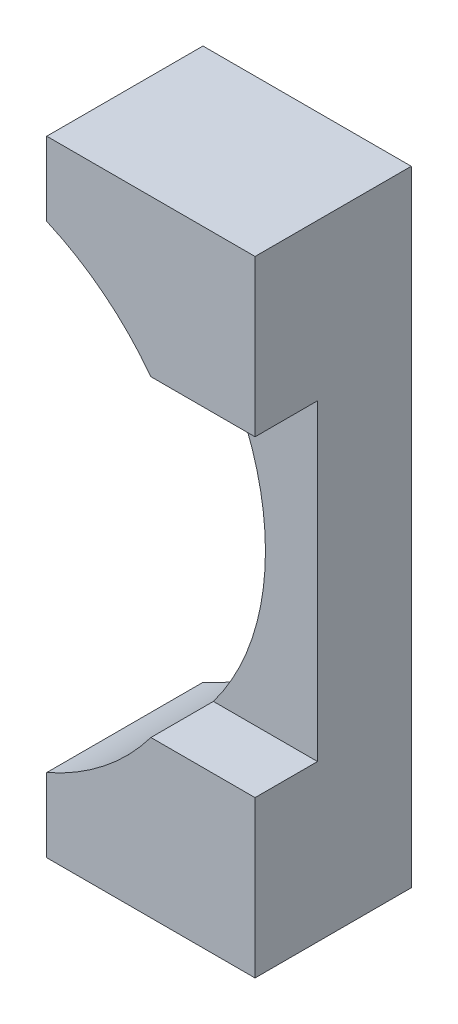
ISO-10303-21;
HEADER;
FILE_DESCRIPTION(('STEP AP214'),'2;1');
FILE_NAME('part.step','',(''),(''),'','','');
FILE_SCHEMA(('AUTOMOTIVE_DESIGN { 1 0 10303 214 1 1 1 1 }'));
ENDSEC;
DATA;
#1=APPLICATION_CONTEXT('core data for automotive mechanical design processes');
#2=APPLICATION_PROTOCOL_DEFINITION('international standard','automotive_design',2000,#1);
#3=PRODUCT_CONTEXT('',#1,'mechanical');
#4=PRODUCT('Part','Part','',(#3));
#5=PRODUCT_RELATED_PRODUCT_CATEGORY('part','',(#4));
#6=PRODUCT_DEFINITION_FORMATION('','',#4);
#7=PRODUCT_DEFINITION_CONTEXT('part definition',#1,'design');
#8=PRODUCT_DEFINITION('design','',#6,#7);
#9=PRODUCT_DEFINITION_SHAPE('','',#8);
#10=(LENGTH_UNIT() NAMED_UNIT(*) SI_UNIT(.MILLI.,.METRE.));
#11=(NAMED_UNIT(*) PLANE_ANGLE_UNIT() SI_UNIT($,.RADIAN.));
#12=(NAMED_UNIT(*) SI_UNIT($,.STERADIAN.) SOLID_ANGLE_UNIT());
#13=UNCERTAINTY_MEASURE_WITH_UNIT(LENGTH_MEASURE(1.E-05),#10,'distance_accuracy_value','');
#14=(GEOMETRIC_REPRESENTATION_CONTEXT(3) GLOBAL_UNCERTAINTY_ASSIGNED_CONTEXT((#13)) GLOBAL_UNIT_ASSIGNED_CONTEXT((#10,
#11,#12)) REPRESENTATION_CONTEXT('',''));
#15=CARTESIAN_POINT('',(0.,0.,0.));
#16=DIRECTION('',(0.,0.,1.));
#17=DIRECTION('',(1.,0.,0.));
#18=AXIS2_PLACEMENT_3D('',#15,#16,#17);
#19=CARTESIAN_POINT('',(0.,0.,19.05));
#20=DIRECTION('',(0.,0.,-1.));
#21=DIRECTION('',(-1.,0.,0.));
#22=AXIS2_PLACEMENT_3D('',#19,#20,#21);
#23=PLANE('',#22);
#24=CARTESIAN_POINT('',(-12.7,38.1,19.05));
#25=DIRECTION('',(0.,0.,1.));
#26=DIRECTION('',(1.,0.,0.));
#27=AXIS2_PLACEMENT_3D('',#24,#25,#26);
#28=CIRCLE('',#27,31.75);
#29=CARTESIAN_POINT('',(12.7,57.15,19.05));
#30=VERTEX_POINT('',#29);
#31=CARTESIAN_POINT('',(0.,67.1993556629696,19.05));
#32=VERTEX_POINT('',#31);
#33=EDGE_CURVE('E179',#30,#32,#28,.T.);
#34=ORIENTED_EDGE('',*,*,#33,.F.);
#35=DIRECTION('',(1.,0.,0.));
#36=VECTOR('',#35,1.);
#37=CARTESIAN_POINT('',(0.,57.15,19.05));
#38=LINE('',#37,#36);
#39=CARTESIAN_POINT('',(25.4,57.15,19.05));
#40=VERTEX_POINT('',#39);
#41=EDGE_CURVE('E176',#30,#40,#38,.T.);
#42=ORIENTED_EDGE('',*,*,#41,.T.);
#43=DIRECTION('',(0.,1.,0.));
#44=VECTOR('',#43,1.);
#45=CARTESIAN_POINT('',(25.4,0.,19.05));
#46=LINE('',#45,#44);
#47=CARTESIAN_POINT('',(25.4,76.2,19.05));
#48=VERTEX_POINT('',#47);
#49=EDGE_CURVE('E138',#40,#48,#46,.T.);
#50=ORIENTED_EDGE('',*,*,#49,.T.);
#51=DIRECTION('',(-1.,0.,0.));
#52=VECTOR('',#51,1.);
#53=CARTESIAN_POINT('',(0.,76.2,19.05));
#54=LINE('',#53,#52);
#55=CARTESIAN_POINT('',(0.,76.2,19.05));
#56=VERTEX_POINT('',#55);
#57=EDGE_CURVE('E137',#48,#56,#54,.T.);
#58=ORIENTED_EDGE('',*,*,#57,.T.);
#59=DIRECTION('',(0.,-1.,0.));
#60=VECTOR('',#59,1.);
#61=CARTESIAN_POINT('',(0.,0.,19.05));
#62=LINE('',#61,#60);
#63=EDGE_CURVE('E189',#56,#32,#62,.T.);
#64=ORIENTED_EDGE('',*,*,#63,.T.);
#65=EDGE_LOOP('',(#34,#42,#50,#58,#64));
#66=FACE_BOUND('',#65,.T.);
#67=ADVANCED_FACE('F35',(#66),#23,.F.);
#68=CARTESIAN_POINT('',(0.,0.,19.05));
#69=DIRECTION('',(1.,0.,0.));
#70=DIRECTION('',(0.,0.,-1.));
#71=AXIS2_PLACEMENT_3D('',#68,#69,#70);
#72=PLANE('',#71);
#73=DIRECTION('',(0.,-1.,0.));
#74=VECTOR('',#73,1.);
#75=CARTESIAN_POINT('',(0.,0.,0.));
#76=LINE('',#75,#74);
#77=CARTESIAN_POINT('',(0.,76.2,0.));
#78=VERTEX_POINT('',#77);
#79=CARTESIAN_POINT('',(0.,67.1993556629696,0.));
#80=VERTEX_POINT('',#79);
#81=EDGE_CURVE('E145',#78,#80,#76,.T.);
#82=ORIENTED_EDGE('',*,*,#81,.T.);
#83=DIRECTION('',(0.,0.,1.));
#84=VECTOR('',#83,1.);
#85=CARTESIAN_POINT('',(0.,67.1993556629696,-6.35));
#86=LINE('',#85,#84);
#87=EDGE_CURVE('E58',#80,#32,#86,.T.);
#88=ORIENTED_EDGE('',*,*,#87,.T.);
#89=ORIENTED_EDGE('',*,*,#63,.F.);
#90=DIRECTION('',(0.,0.,-1.));
#91=VECTOR('',#90,1.);
#92=CARTESIAN_POINT('',(0.,76.2,19.05));
#93=LINE('',#92,#91);
#94=EDGE_CURVE('E140',#56,#78,#93,.T.);
#95=ORIENTED_EDGE('',*,*,#94,.T.);
#96=EDGE_LOOP('',(#82,#88,#89,#95));
#97=FACE_BOUND('',#96,.T.);
#98=ADVANCED_FACE('F211',(#97),#72,.F.);
#99=CARTESIAN_POINT('',(0.,9.00064433703042,19.05));
#100=VERTEX_POINT('',#99);
#101=CARTESIAN_POINT('',(0.,0.,19.05));
#102=VERTEX_POINT('',#101);
#103=EDGE_CURVE('E155',#100,#102,#62,.T.);
#104=ORIENTED_EDGE('',*,*,#103,.F.);
#105=DIRECTION('',(0.,0.,1.));
#106=VECTOR('',#105,1.);
#107=CARTESIAN_POINT('',(0.,9.00064433703042,-6.35));
#108=LINE('',#107,#106);
#109=CARTESIAN_POINT('',(0.,9.00064433703042,0.));
#110=VERTEX_POINT('',#109);
#111=EDGE_CURVE('E186',#100,#110,#108,.F.);
#112=ORIENTED_EDGE('',*,*,#111,.T.);
#113=CARTESIAN_POINT('',(0.,0.,0.));
#114=VERTEX_POINT('',#113);
#115=EDGE_CURVE('E149',#110,#114,#76,.T.);
#116=ORIENTED_EDGE('',*,*,#115,.T.);
#117=DIRECTION('',(0.,0.,-1.));
#118=VECTOR('',#117,1.);
#119=CARTESIAN_POINT('',(0.,0.,19.05));
#120=LINE('',#119,#118);
#121=EDGE_CURVE('E163',#102,#114,#120,.T.);
#122=ORIENTED_EDGE('',*,*,#121,.F.);
#123=EDGE_LOOP('',(#104,#112,#116,#122));
#124=FACE_BOUND('',#123,.T.);
#125=ADVANCED_FACE('F37',(#124),#72,.F.);
#126=CARTESIAN_POINT('',(0.,0.,19.05));
#127=DIRECTION('',(0.,1.,0.));
#128=DIRECTION('',(0.,0.,1.));
#129=AXIS2_PLACEMENT_3D('',#126,#127,#128);
#130=PLANE('',#129);
#131=DIRECTION('',(1.,0.,0.));
#132=VECTOR('',#131,1.);
#133=CARTESIAN_POINT('',(0.,0.,0.));
#134=LINE('',#133,#132);
#135=CARTESIAN_POINT('',(25.4,0.,0.));
#136=VERTEX_POINT('',#135);
#137=EDGE_CURVE('E148',#114,#136,#134,.T.);
#138=ORIENTED_EDGE('',*,*,#137,.T.);
#139=DIRECTION('',(0.,0.,-1.));
#140=VECTOR('',#139,1.);
#141=CARTESIAN_POINT('',(25.4,0.,19.05));
#142=LINE('',#141,#140);
#143=CARTESIAN_POINT('',(25.4,0.,19.05));
#144=VERTEX_POINT('',#143);
#145=EDGE_CURVE('E161',#144,#136,#142,.T.);
#146=ORIENTED_EDGE('',*,*,#145,.F.);
#147=DIRECTION('',(1.,0.,0.));
#148=VECTOR('',#147,1.);
#149=CARTESIAN_POINT('',(0.,0.,19.05));
#150=LINE('',#149,#148);
#151=EDGE_CURVE('E135',#102,#144,#150,.T.);
#152=ORIENTED_EDGE('',*,*,#151,.F.);
#153=ORIENTED_EDGE('',*,*,#121,.T.);
#154=EDGE_LOOP('',(#138,#146,#152,#153));
#155=FACE_BOUND('',#154,.T.);
#156=ADVANCED_FACE('F197',(#155),#130,.F.);
#157=CARTESIAN_POINT('',(25.4,0.,19.05));
#158=DIRECTION('',(-1.,0.,0.));
#159=DIRECTION('',(0.,0.,1.));
#160=AXIS2_PLACEMENT_3D('',#157,#158,#159);
#161=PLANE('',#160);
#162=ORIENTED_EDGE('',*,*,#49,.F.);
#163=DIRECTION('',(0.,0.,1.));
#164=VECTOR('',#163,1.);
#165=CARTESIAN_POINT('',(25.4,57.15,19.05));
#166=LINE('',#165,#164);
#167=CARTESIAN_POINT('',(25.4,57.15,11.43));
#168=VERTEX_POINT('',#167);
#169=EDGE_CURVE('E121',#168,#40,#166,.T.);
#170=ORIENTED_EDGE('',*,*,#169,.F.);
#171=DIRECTION('',(0.,1.,0.));
#172=VECTOR('',#171,1.);
#173=CARTESIAN_POINT('',(25.4,57.15,11.43));
#174=LINE('',#173,#172);
#175=CARTESIAN_POINT('',(25.4,19.05,11.43));
#176=VERTEX_POINT('',#175);
#177=EDGE_CURVE('E131',#176,#168,#174,.T.);
#178=ORIENTED_EDGE('',*,*,#177,.F.);
#179=DIRECTION('',(0.,0.,-1.));
#180=VECTOR('',#179,1.);
#181=CARTESIAN_POINT('',(25.4,19.05,19.05));
#182=LINE('',#181,#180);
#183=CARTESIAN_POINT('',(25.4,19.05,19.05));
#184=VERTEX_POINT('',#183);
#185=EDGE_CURVE('E113',#184,#176,#182,.T.);
#186=ORIENTED_EDGE('',*,*,#185,.F.);
#187=EDGE_CURVE('E128',#144,#184,#46,.T.);
#188=ORIENTED_EDGE('',*,*,#187,.F.);
#189=ORIENTED_EDGE('',*,*,#145,.T.);
#190=DIRECTION('',(0.,1.,0.));
#191=VECTOR('',#190,1.);
#192=CARTESIAN_POINT('',(25.4,0.,0.));
#193=LINE('',#192,#191);
#194=CARTESIAN_POINT('',(25.4,76.2,0.));
#195=VERTEX_POINT('',#194);
#196=EDGE_CURVE('E151',#136,#195,#193,.T.);
#197=ORIENTED_EDGE('',*,*,#196,.T.);
#198=DIRECTION('',(0.,0.,-1.));
#199=VECTOR('',#198,1.);
#200=CARTESIAN_POINT('',(25.4,76.2,19.05));
#201=LINE('',#200,#199);
#202=EDGE_CURVE('E158',#48,#195,#201,.T.);
#203=ORIENTED_EDGE('',*,*,#202,.F.);
#204=EDGE_LOOP('',(#162,#170,#178,#186,#188,#189,#197,#203));
#205=FACE_BOUND('',#204,.T.);
#206=ADVANCED_FACE('F126',(#205),#161,.F.);
#207=CARTESIAN_POINT('',(0.,76.2,19.05));
#208=DIRECTION('',(0.,-1.,0.));
#209=DIRECTION('',(0.,0.,-1.));
#210=AXIS2_PLACEMENT_3D('',#207,#208,#209);
#211=PLANE('',#210);
#212=DIRECTION('',(-1.,0.,0.));
#213=VECTOR('',#212,1.);
#214=CARTESIAN_POINT('',(0.,76.2,0.));
#215=LINE('',#214,#213);
#216=EDGE_CURVE('E153',#195,#78,#215,.T.);
#217=ORIENTED_EDGE('',*,*,#216,.T.);
#218=ORIENTED_EDGE('',*,*,#94,.F.);
#219=ORIENTED_EDGE('',*,*,#57,.F.);
#220=ORIENTED_EDGE('',*,*,#202,.T.);
#221=EDGE_LOOP('',(#217,#218,#219,#220));
#222=FACE_BOUND('',#221,.T.);
#223=ADVANCED_FACE('F207',(#222),#211,.F.);
#224=ORIENTED_EDGE('',*,*,#187,.T.);
#225=DIRECTION('',(1.,0.,0.));
#226=VECTOR('',#225,1.);
#227=CARTESIAN_POINT('',(0.,19.05,19.05));
#228=LINE('',#227,#226);
#229=CARTESIAN_POINT('',(12.7,19.05,19.05));
#230=VERTEX_POINT('',#229);
#231=EDGE_CURVE('E110',#230,#184,#228,.T.);
#232=ORIENTED_EDGE('',*,*,#231,.F.);
#233=EDGE_CURVE('E184',#100,#230,#28,.T.);
#234=ORIENTED_EDGE('',*,*,#233,.F.);
#235=ORIENTED_EDGE('',*,*,#103,.T.);
#236=ORIENTED_EDGE('',*,*,#151,.T.);
#237=EDGE_LOOP('',(#224,#232,#234,#235,#236));
#238=FACE_BOUND('',#237,.T.);
#239=ADVANCED_FACE('F133',(#238),#23,.F.);
#240=CARTESIAN_POINT('',(0.,0.,0.));
#241=DIRECTION('',(0.,0.,-1.));
#242=DIRECTION('',(-1.,0.,0.));
#243=AXIS2_PLACEMENT_3D('',#240,#241,#242);
#244=PLANE('',#243);
#245=CARTESIAN_POINT('',(-12.7,38.1,0.));
#246=DIRECTION('',(0.,0.,-1.));
#247=DIRECTION('',(-1.,0.,0.));
#248=AXIS2_PLACEMENT_3D('',#245,#246,#247);
#249=CIRCLE('',#248,31.75);
#250=EDGE_CURVE('E166',#80,#110,#249,.T.);
#251=ORIENTED_EDGE('',*,*,#250,.F.);
#252=ORIENTED_EDGE('',*,*,#81,.F.);
#253=ORIENTED_EDGE('',*,*,#216,.F.);
#254=ORIENTED_EDGE('',*,*,#196,.F.);
#255=ORIENTED_EDGE('',*,*,#137,.F.);
#256=ORIENTED_EDGE('',*,*,#115,.F.);
#257=EDGE_LOOP('',(#251,#252,#253,#254,#255,#256));
#258=FACE_BOUND('',#257,.T.);
#259=ADVANCED_FACE('F202',(#258),#244,.T.);
#260=CARTESIAN_POINT('',(-12.7,38.1,-6.35));
#261=DIRECTION('',(0.,0.,1.));
#262=DIRECTION('',(1.,0.,0.));
#263=AXIS2_PLACEMENT_3D('',#260,#261,#262);
#264=CYLINDRICAL_SURFACE('',#263,31.75);
#265=CARTESIAN_POINT('',(-12.7,38.1,11.43));
#266=DIRECTION('',(0.,0.,-1.));
#267=DIRECTION('',(-1.,0.,0.));
#268=AXIS2_PLACEMENT_3D('',#265,#266,#267);
#269=CIRCLE('',#268,31.75);
#270=CARTESIAN_POINT('',(12.7,19.05,11.43));
#271=VERTEX_POINT('',#270);
#272=CARTESIAN_POINT('',(12.7,57.15,11.43));
#273=VERTEX_POINT('',#272);
#274=EDGE_CURVE('E43',#271,#273,#269,.F.);
#275=ORIENTED_EDGE('',*,*,#274,.T.);
#276=DIRECTION('',(0.,0.,1.));
#277=VECTOR('',#276,1.);
#278=CARTESIAN_POINT('',(12.7,57.15,-6.35));
#279=LINE('',#278,#277);
#280=EDGE_CURVE('E11',#273,#30,#279,.T.);
#281=ORIENTED_EDGE('',*,*,#280,.T.);
#282=ORIENTED_EDGE('',*,*,#33,.T.);
#283=ORIENTED_EDGE('',*,*,#87,.F.);
#284=ORIENTED_EDGE('',*,*,#250,.T.);
#285=ORIENTED_EDGE('',*,*,#111,.F.);
#286=ORIENTED_EDGE('',*,*,#233,.T.);
#287=DIRECTION('',(0.,0.,1.));
#288=VECTOR('',#287,1.);
#289=CARTESIAN_POINT('',(12.7,19.05,-6.35));
#290=LINE('',#289,#288);
#291=EDGE_CURVE('E116',#230,#271,#290,.F.);
#292=ORIENTED_EDGE('',*,*,#291,.T.);
#293=EDGE_LOOP('',(#275,#281,#282,#283,#284,#285,#286,#292));
#294=FACE_BOUND('',#293,.T.);
#295=ADVANCED_FACE('F169',(#294),#264,.F.);
#296=CARTESIAN_POINT('',(0.,57.15,19.05));
#297=DIRECTION('',(0.,1.,0.));
#298=DIRECTION('',(0.,0.,1.));
#299=AXIS2_PLACEMENT_3D('',#296,#297,#298);
#300=PLANE('',#299);
#301=DIRECTION('',(1.,0.,0.));
#302=VECTOR('',#301,1.);
#303=CARTESIAN_POINT('',(0.,57.15,11.43));
#304=LINE('',#303,#302);
#305=EDGE_CURVE('E174',#273,#168,#304,.T.);
#306=ORIENTED_EDGE('',*,*,#305,.T.);
#307=ORIENTED_EDGE('',*,*,#169,.T.);
#308=ORIENTED_EDGE('',*,*,#41,.F.);
#309=ORIENTED_EDGE('',*,*,#280,.F.);
#310=EDGE_LOOP('',(#306,#307,#308,#309));
#311=FACE_BOUND('',#310,.T.);
#312=ADVANCED_FACE('F259',(#311),#300,.F.);
#313=CARTESIAN_POINT('',(0.,57.15,11.43));
#314=DIRECTION('',(0.,0.,-1.));
#315=DIRECTION('',(-1.,0.,0.));
#316=AXIS2_PLACEMENT_3D('',#313,#314,#315);
#317=PLANE('',#316);
#318=DIRECTION('',(1.,0.,0.));
#319=VECTOR('',#318,1.);
#320=CARTESIAN_POINT('',(0.,19.05,11.43));
#321=LINE('',#320,#319);
#322=EDGE_CURVE('E50',#271,#176,#321,.T.);
#323=ORIENTED_EDGE('',*,*,#322,.T.);
#324=ORIENTED_EDGE('',*,*,#177,.T.);
#325=ORIENTED_EDGE('',*,*,#305,.F.);
#326=ORIENTED_EDGE('',*,*,#274,.F.);
#327=EDGE_LOOP('',(#323,#324,#325,#326));
#328=FACE_BOUND('',#327,.T.);
#329=ADVANCED_FACE('F173',(#328),#317,.F.);
#330=CARTESIAN_POINT('',(0.,19.05,19.05));
#331=DIRECTION('',(0.,-1.,0.));
#332=DIRECTION('',(0.,0.,-1.));
#333=AXIS2_PLACEMENT_3D('',#330,#331,#332);
#334=PLANE('',#333);
#335=ORIENTED_EDGE('',*,*,#231,.T.);
#336=ORIENTED_EDGE('',*,*,#185,.T.);
#337=ORIENTED_EDGE('',*,*,#322,.F.);
#338=ORIENTED_EDGE('',*,*,#291,.F.);
#339=EDGE_LOOP('',(#335,#336,#337,#338));
#340=FACE_BOUND('',#339,.T.);
#341=ADVANCED_FACE('F112',(#340),#334,.F.);
#342=CLOSED_SHELL('',(#67,#98,#125,#156,#206,#223,#239,#259,#295,#312,#329,#341));
#343=MANIFOLD_SOLID_BREP('B2',#342);
#344=ADVANCED_BREP_SHAPE_REPRESENTATION('',(#18,#343),#14);
#345=SHAPE_DEFINITION_REPRESENTATION(#9,#344);
ENDSEC;
END-ISO-10303-21;
